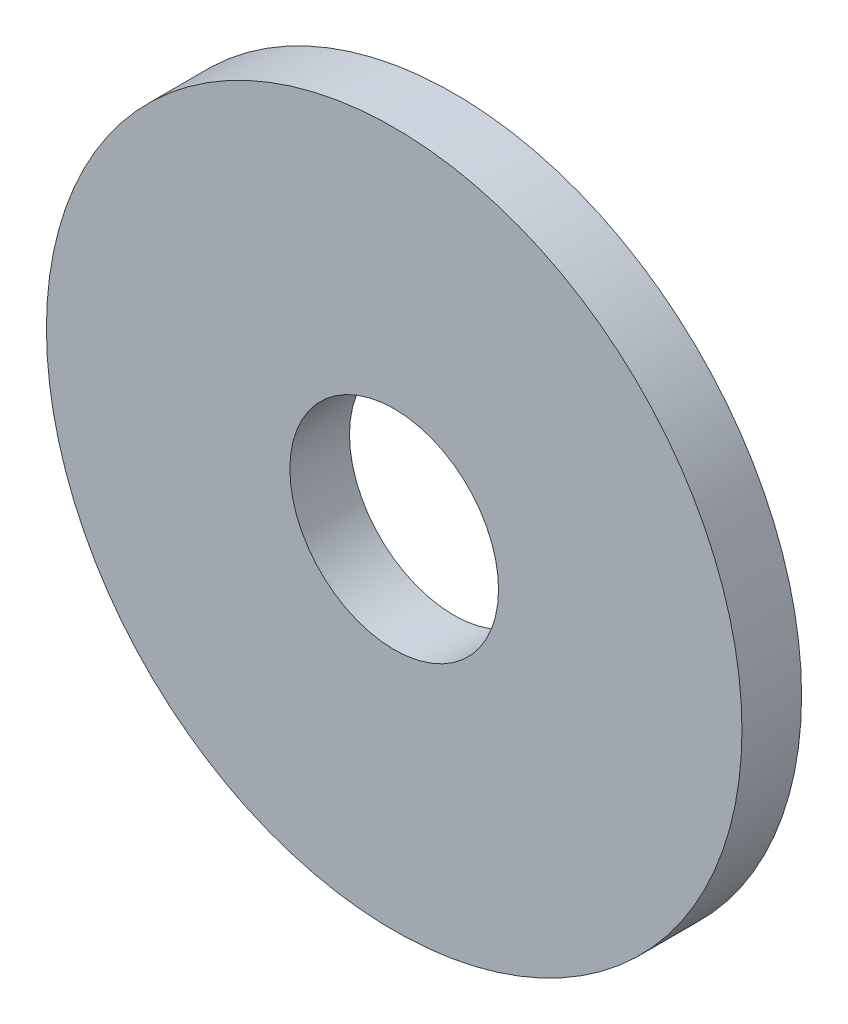
ISO-10303-21;
HEADER;
FILE_DESCRIPTION(('STEP AP214'),'2;1');
FILE_NAME('part.step','',(''),(''),'','','');
FILE_SCHEMA(('AUTOMOTIVE_DESIGN { 1 0 10303 214 1 1 1 1 }'));
ENDSEC;
DATA;
#1=APPLICATION_CONTEXT('core data for automotive mechanical design processes');
#2=APPLICATION_PROTOCOL_DEFINITION('international standard','automotive_design',2000,#1);
#3=PRODUCT_CONTEXT('',#1,'mechanical');
#4=PRODUCT('Part','Part','',(#3));
#5=PRODUCT_RELATED_PRODUCT_CATEGORY('part','',(#4));
#6=PRODUCT_DEFINITION_FORMATION('','',#4);
#7=PRODUCT_DEFINITION_CONTEXT('part definition',#1,'design');
#8=PRODUCT_DEFINITION('design','',#6,#7);
#9=PRODUCT_DEFINITION_SHAPE('','',#8);
#10=(LENGTH_UNIT() NAMED_UNIT(*) SI_UNIT(.MILLI.,.METRE.));
#11=(NAMED_UNIT(*) PLANE_ANGLE_UNIT() SI_UNIT($,.RADIAN.));
#12=(NAMED_UNIT(*) SI_UNIT($,.STERADIAN.) SOLID_ANGLE_UNIT());
#13=UNCERTAINTY_MEASURE_WITH_UNIT(LENGTH_MEASURE(1.E-05),#10,'distance_accuracy_value','');
#14=(GEOMETRIC_REPRESENTATION_CONTEXT(3) GLOBAL_UNCERTAINTY_ASSIGNED_CONTEXT((#13)) GLOBAL_UNIT_ASSIGNED_CONTEXT((#10,
#11,#12)) REPRESENTATION_CONTEXT('',''));
#15=CARTESIAN_POINT('',(0.,0.,0.));
#16=DIRECTION('',(0.,0.,1.));
#17=DIRECTION('',(1.,0.,0.));
#18=AXIS2_PLACEMENT_3D('',#15,#16,#17);
#19=CARTESIAN_POINT('',(0.,0.,3.));
#20=DIRECTION('',(0.,0.,0.999999999999999));
#21=DIRECTION('',(1.,0.,0.));
#22=AXIS2_PLACEMENT_3D('',#19,#20,#21);
#23=PLANE('',#22);
#24=CARTESIAN_POINT('',(0.,0.,3.));
#25=DIRECTION('',(0.,0.,0.999999999999999));
#26=DIRECTION('',(1.,0.,0.));
#27=AXIS2_PLACEMENT_3D('',#24,#25,#26);
#28=CIRCLE('',#27,17.5);
#29=CARTESIAN_POINT('',(17.5,0.,3.));
#30=VERTEX_POINT('',#29);
#31=EDGE_CURVE('E10',#30,#30,#28,.T.);
#32=ORIENTED_EDGE('',*,*,#31,.T.);
#33=EDGE_LOOP('',(#32));
#34=FACE_BOUND('',#33,.T.);
#35=CARTESIAN_POINT('',(0.,0.,3.));
#36=DIRECTION('',(0.,0.,0.999999999999999));
#37=DIRECTION('',(1.,0.,0.));
#38=AXIS2_PLACEMENT_3D('',#35,#36,#37);
#39=CIRCLE('',#38,5.25);
#40=CARTESIAN_POINT('',(5.25,0.,3.));
#41=VERTEX_POINT('',#40);
#42=EDGE_CURVE('E43',#41,#41,#39,.T.);
#43=ORIENTED_EDGE('',*,*,#42,.F.);
#44=EDGE_LOOP('',(#43));
#45=FACE_BOUND('',#44,.T.);
#46=ADVANCED_FACE('F32',(#34,#45),#23,.T.);
#47=CARTESIAN_POINT('',(0.,0.,0.));
#48=DIRECTION('',(0.,0.,0.999999999999999));
#49=DIRECTION('',(1.,0.,0.));
#50=AXIS2_PLACEMENT_3D('',#47,#48,#49);
#51=PLANE('',#50);
#52=CARTESIAN_POINT('',(0.,0.,0.));
#53=DIRECTION('',(0.,0.,0.999999999999999));
#54=DIRECTION('',(1.,0.,0.));
#55=AXIS2_PLACEMENT_3D('',#52,#53,#54);
#56=CIRCLE('',#55,17.5);
#57=CARTESIAN_POINT('',(17.5,0.,0.));
#58=VERTEX_POINT('',#57);
#59=EDGE_CURVE('E36',#58,#58,#56,.T.);
#60=ORIENTED_EDGE('',*,*,#59,.F.);
#61=EDGE_LOOP('',(#60));
#62=FACE_BOUND('',#61,.T.);
#63=CARTESIAN_POINT('',(0.,0.,0.));
#64=DIRECTION('',(0.,0.,0.999999999999999));
#65=DIRECTION('',(1.,0.,0.));
#66=AXIS2_PLACEMENT_3D('',#63,#64,#65);
#67=CIRCLE('',#66,5.25);
#68=CARTESIAN_POINT('',(5.25,0.,0.));
#69=VERTEX_POINT('',#68);
#70=EDGE_CURVE('E45',#69,#69,#67,.T.);
#71=ORIENTED_EDGE('',*,*,#70,.T.);
#72=EDGE_LOOP('',(#71));
#73=FACE_BOUND('',#72,.T.);
#74=ADVANCED_FACE('F55',(#62,#73),#51,.F.);
#75=CARTESIAN_POINT('',(0.,0.,3.));
#76=DIRECTION('',(0.,0.,-0.999999999999999));
#77=DIRECTION('',(-1.,0.,0.));
#78=AXIS2_PLACEMENT_3D('',#75,#76,#77);
#79=CYLINDRICAL_SURFACE('',#78,17.5);
#80=ORIENTED_EDGE('',*,*,#31,.F.);
#81=EDGE_LOOP('',(#80));
#82=FACE_BOUND('',#81,.T.);
#83=ORIENTED_EDGE('',*,*,#59,.T.);
#84=EDGE_LOOP('',(#83));
#85=FACE_BOUND('',#84,.T.);
#86=ADVANCED_FACE('F34',(#82,#85),#79,.T.);
#87=CARTESIAN_POINT('',(0.,0.,3.));
#88=DIRECTION('',(0.,0.,-0.999999999999999));
#89=DIRECTION('',(-1.,0.,0.));
#90=AXIS2_PLACEMENT_3D('',#87,#88,#89);
#91=CYLINDRICAL_SURFACE('',#90,5.25);
#92=ORIENTED_EDGE('',*,*,#42,.T.);
#93=EDGE_LOOP('',(#92));
#94=FACE_BOUND('',#93,.T.);
#95=ORIENTED_EDGE('',*,*,#70,.F.);
#96=EDGE_LOOP('',(#95));
#97=FACE_BOUND('',#96,.T.);
#98=ADVANCED_FACE('F51',(#94,#97),#91,.F.);
#99=CLOSED_SHELL('',(#46,#74,#86,#98));
#100=MANIFOLD_SOLID_BREP('B2',#99);
#101=ADVANCED_BREP_SHAPE_REPRESENTATION('',(#18,#100),#14);
#102=SHAPE_DEFINITION_REPRESENTATION(#9,#101);
ENDSEC;
END-ISO-10303-21;
